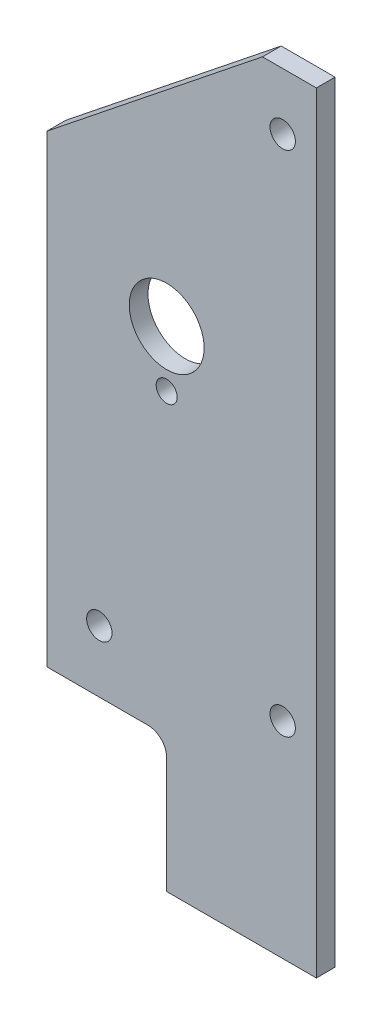
ISO-10303-21;
HEADER;
FILE_DESCRIPTION(('STEP AP214'),'2;1');
FILE_NAME('part.step','',(''),(''),'','','');
FILE_SCHEMA(('AUTOMOTIVE_DESIGN { 1 0 10303 214 1 1 1 1 }'));
ENDSEC;
DATA;
#1=APPLICATION_CONTEXT('core data for automotive mechanical design processes');
#2=APPLICATION_PROTOCOL_DEFINITION('international standard','automotive_design',2000,#1);
#3=PRODUCT_CONTEXT('',#1,'mechanical');
#4=PRODUCT('Part','Part','',(#3));
#5=PRODUCT_RELATED_PRODUCT_CATEGORY('part','',(#4));
#6=PRODUCT_DEFINITION_FORMATION('','',#4);
#7=PRODUCT_DEFINITION_CONTEXT('part definition',#1,'design');
#8=PRODUCT_DEFINITION('design','',#6,#7);
#9=PRODUCT_DEFINITION_SHAPE('','',#8);
#10=(LENGTH_UNIT() NAMED_UNIT(*) SI_UNIT(.MILLI.,.METRE.));
#11=(NAMED_UNIT(*) PLANE_ANGLE_UNIT() SI_UNIT($,.RADIAN.));
#12=(NAMED_UNIT(*) SI_UNIT($,.STERADIAN.) SOLID_ANGLE_UNIT());
#13=UNCERTAINTY_MEASURE_WITH_UNIT(LENGTH_MEASURE(1.E-05),#10,'distance_accuracy_value','');
#14=(GEOMETRIC_REPRESENTATION_CONTEXT(3) GLOBAL_UNCERTAINTY_ASSIGNED_CONTEXT((#13)) GLOBAL_UNIT_ASSIGNED_CONTEXT((#10,
#11,#12)) REPRESENTATION_CONTEXT('',''));
#15=CARTESIAN_POINT('',(0.,0.,0.));
#16=DIRECTION('',(0.,0.,1.));
#17=DIRECTION('',(1.,0.,0.));
#18=AXIS2_PLACEMENT_3D('',#15,#16,#17);
#19=CARTESIAN_POINT('',(-25.4,19.685,-3.175));
#20=DIRECTION('',(-1.,0.,0.));
#21=DIRECTION('',(0.,-1.,0.));
#22=AXIS2_PLACEMENT_3D('',#19,#20,#21);
#23=PLANE('',#22);
#24=DIRECTION('',(0.,-1.,0.));
#25=VECTOR('',#24,1.);
#26=CARTESIAN_POINT('',(-25.4,19.685,0.));
#27=LINE('',#26,#25);
#28=CARTESIAN_POINT('',(-25.4,19.685,0.));
#29=VERTEX_POINT('',#28);
#30=CARTESIAN_POINT('',(-25.4,0.,0.));
#31=VERTEX_POINT('',#30);
#32=EDGE_CURVE('E129',#29,#31,#27,.T.);
#33=ORIENTED_EDGE('',*,*,#32,.F.);
#34=DIRECTION('',(0.,0.,1.));
#35=VECTOR('',#34,1.);
#36=CARTESIAN_POINT('',(-25.4,19.685,-3.175));
#37=LINE('',#36,#35);
#38=CARTESIAN_POINT('',(-25.4,19.685,-3.175));
#39=VERTEX_POINT('',#38);
#40=EDGE_CURVE('E11',#39,#29,#37,.T.);
#41=ORIENTED_EDGE('',*,*,#40,.F.);
#42=DIRECTION('',(0.,-1.,0.));
#43=VECTOR('',#42,1.);
#44=CARTESIAN_POINT('',(-25.4,19.685,-3.175));
#45=LINE('',#44,#43);
#46=CARTESIAN_POINT('',(-25.4,0.,-3.175));
#47=VERTEX_POINT('',#46);
#48=EDGE_CURVE('E150',#39,#47,#45,.T.);
#49=ORIENTED_EDGE('',*,*,#48,.T.);
#50=DIRECTION('',(0.,0.,1.));
#51=VECTOR('',#50,1.);
#52=CARTESIAN_POINT('',(-25.4,0.,-3.175));
#53=LINE('',#52,#51);
#54=EDGE_CURVE('E35',#47,#31,#53,.T.);
#55=ORIENTED_EDGE('',*,*,#54,.T.);
#56=EDGE_LOOP('',(#33,#41,#49,#55));
#57=FACE_BOUND('',#56,.T.);
#58=ADVANCED_FACE('F32',(#57),#23,.T.);
#59=CARTESIAN_POINT('',(-28.575,19.685,-3.175));
#60=DIRECTION('',(0.,0.,1.));
#61=DIRECTION('',(1.,0.,0.));
#62=AXIS2_PLACEMENT_3D('',#59,#60,#61);
#63=CYLINDRICAL_SURFACE('',#62,3.175);
#64=CARTESIAN_POINT('',(-28.575,19.685,0.));
#65=DIRECTION('',(0.,0.,-1.));
#66=DIRECTION('',(1.,0.,0.));
#67=AXIS2_PLACEMENT_3D('',#64,#65,#66);
#68=CIRCLE('',#67,3.175);
#69=CARTESIAN_POINT('',(-28.575,22.86,0.));
#70=VERTEX_POINT('',#69);
#71=EDGE_CURVE('E148',#70,#29,#68,.T.);
#72=ORIENTED_EDGE('',*,*,#71,.F.);
#73=DIRECTION('',(0.,0.,1.));
#74=VECTOR('',#73,1.);
#75=CARTESIAN_POINT('',(-28.575,22.86,-3.175));
#76=LINE('',#75,#74);
#77=CARTESIAN_POINT('',(-28.575,22.86,-3.175));
#78=VERTEX_POINT('',#77);
#79=EDGE_CURVE('E41',#78,#70,#76,.T.);
#80=ORIENTED_EDGE('',*,*,#79,.F.);
#81=CARTESIAN_POINT('',(-28.575,19.685,-3.175));
#82=DIRECTION('',(0.,0.,-1.));
#83=DIRECTION('',(1.,0.,0.));
#84=AXIS2_PLACEMENT_3D('',#81,#82,#83);
#85=CIRCLE('',#84,3.175);
#86=EDGE_CURVE('E119',#78,#39,#85,.T.);
#87=ORIENTED_EDGE('',*,*,#86,.T.);
#88=ORIENTED_EDGE('',*,*,#40,.T.);
#89=EDGE_LOOP('',(#72,#80,#87,#88));
#90=FACE_BOUND('',#89,.T.);
#91=ADVANCED_FACE('F162',(#90),#63,.F.);
#92=CARTESIAN_POINT('',(-45.72,22.86,-3.175));
#93=DIRECTION('',(0.,-1.,0.));
#94=DIRECTION('',(0.,0.,-1.));
#95=AXIS2_PLACEMENT_3D('',#92,#93,#94);
#96=PLANE('',#95);
#97=DIRECTION('',(1.,0.,0.));
#98=VECTOR('',#97,1.);
#99=CARTESIAN_POINT('',(-45.72,22.86,0.));
#100=LINE('',#99,#98);
#101=CARTESIAN_POINT('',(-45.72,22.86,0.));
#102=VERTEX_POINT('',#101);
#103=EDGE_CURVE('E106',#102,#70,#100,.T.);
#104=ORIENTED_EDGE('',*,*,#103,.F.);
#105=DIRECTION('',(0.,0.,1.));
#106=VECTOR('',#105,1.);
#107=CARTESIAN_POINT('',(-45.72,22.86,-3.175));
#108=LINE('',#107,#106);
#109=CARTESIAN_POINT('',(-45.72,22.86,-3.175));
#110=VERTEX_POINT('',#109);
#111=EDGE_CURVE('E101',#110,#102,#108,.T.);
#112=ORIENTED_EDGE('',*,*,#111,.F.);
#113=DIRECTION('',(1.,0.,0.));
#114=VECTOR('',#113,1.);
#115=CARTESIAN_POINT('',(-45.72,22.86,-3.175));
#116=LINE('',#115,#114);
#117=EDGE_CURVE('E104',#110,#78,#116,.T.);
#118=ORIENTED_EDGE('',*,*,#117,.T.);
#119=ORIENTED_EDGE('',*,*,#79,.T.);
#120=EDGE_LOOP('',(#104,#112,#118,#119));
#121=FACE_BOUND('',#120,.T.);
#122=ADVANCED_FACE('F103',(#121),#96,.T.);
#123=CARTESIAN_POINT('',(-45.72,101.6,-3.175));
#124=DIRECTION('',(-1.,0.,0.));
#125=DIRECTION('',(0.,0.,1.));
#126=AXIS2_PLACEMENT_3D('',#123,#124,#125);
#127=PLANE('',#126);
#128=DIRECTION('',(0.,-1.,0.));
#129=VECTOR('',#128,1.);
#130=CARTESIAN_POINT('',(-45.72,101.6,0.));
#131=LINE('',#130,#129);
#132=CARTESIAN_POINT('',(-45.72,101.6,0.));
#133=VERTEX_POINT('',#132);
#134=EDGE_CURVE('E145',#133,#102,#131,.T.);
#135=ORIENTED_EDGE('',*,*,#134,.F.);
#136=DIRECTION('',(0.,0.,1.));
#137=VECTOR('',#136,1.);
#138=CARTESIAN_POINT('',(-45.72,101.6,-3.175));
#139=LINE('',#138,#137);
#140=CARTESIAN_POINT('',(-45.72,101.6,-3.175));
#141=VERTEX_POINT('',#140);
#142=EDGE_CURVE('E111',#141,#133,#139,.T.);
#143=ORIENTED_EDGE('',*,*,#142,.F.);
#144=DIRECTION('',(0.,-1.,0.));
#145=VECTOR('',#144,1.);
#146=CARTESIAN_POINT('',(-45.72,101.6,-3.175));
#147=LINE('',#146,#145);
#148=EDGE_CURVE('E117',#141,#110,#147,.T.);
#149=ORIENTED_EDGE('',*,*,#148,.T.);
#150=ORIENTED_EDGE('',*,*,#111,.T.);
#151=EDGE_LOOP('',(#135,#143,#149,#150));
#152=FACE_BOUND('',#151,.T.);
#153=ADVANCED_FACE('F121',(#152),#127,.T.);
#154=CARTESIAN_POINT('',(-9.144,130.81,-3.175));
#155=DIRECTION('',(-0.624033070240706,0.78139793143184,0.));
#156=DIRECTION('',(-0.78139793143184,-0.624033070240706,0.));
#157=AXIS2_PLACEMENT_3D('',#154,#155,#156);
#158=PLANE('',#157);
#159=DIRECTION('',(-0.78139793143184,-0.624033070240706,0.));
#160=VECTOR('',#159,1.);
#161=CARTESIAN_POINT('',(-9.144,130.81,0.));
#162=LINE('',#161,#160);
#163=CARTESIAN_POINT('',(-9.144,130.81,0.));
#164=VERTEX_POINT('',#163);
#165=EDGE_CURVE('E142',#164,#133,#162,.T.);
#166=ORIENTED_EDGE('',*,*,#165,.F.);
#167=DIRECTION('',(0.,0.,1.));
#168=VECTOR('',#167,1.);
#169=CARTESIAN_POINT('',(-9.144,130.81,-3.175));
#170=LINE('',#169,#168);
#171=CARTESIAN_POINT('',(-9.144,130.81,-3.175));
#172=VERTEX_POINT('',#171);
#173=EDGE_CURVE('E154',#172,#164,#170,.T.);
#174=ORIENTED_EDGE('',*,*,#173,.F.);
#175=DIRECTION('',(-0.78139793143184,-0.624033070240706,0.));
#176=VECTOR('',#175,1.);
#177=CARTESIAN_POINT('',(-9.144,130.81,-3.175));
#178=LINE('',#177,#176);
#179=EDGE_CURVE('E122',#172,#141,#178,.T.);
#180=ORIENTED_EDGE('',*,*,#179,.T.);
#181=ORIENTED_EDGE('',*,*,#142,.T.);
#182=EDGE_LOOP('',(#166,#174,#180,#181));
#183=FACE_BOUND('',#182,.T.);
#184=ADVANCED_FACE('F175',(#183),#158,.T.);
#185=CARTESIAN_POINT('',(0.,130.81,-3.175));
#186=DIRECTION('',(0.,1.,0.));
#187=DIRECTION('',(0.,0.,1.));
#188=AXIS2_PLACEMENT_3D('',#185,#186,#187);
#189=PLANE('',#188);
#190=DIRECTION('',(-1.,0.,0.));
#191=VECTOR('',#190,1.);
#192=CARTESIAN_POINT('',(0.,130.81,0.));
#193=LINE('',#192,#191);
#194=CARTESIAN_POINT('',(0.,130.81,0.));
#195=VERTEX_POINT('',#194);
#196=EDGE_CURVE('E139',#195,#164,#193,.T.);
#197=ORIENTED_EDGE('',*,*,#196,.F.);
#198=DIRECTION('',(0.,0.,1.));
#199=VECTOR('',#198,1.);
#200=CARTESIAN_POINT('',(0.,130.81,-3.175));
#201=LINE('',#200,#199);
#202=CARTESIAN_POINT('',(0.,130.81,-3.175));
#203=VERTEX_POINT('',#202);
#204=EDGE_CURVE('E156',#203,#195,#201,.T.);
#205=ORIENTED_EDGE('',*,*,#204,.F.);
#206=DIRECTION('',(-1.,0.,0.));
#207=VECTOR('',#206,1.);
#208=CARTESIAN_POINT('',(0.,130.81,-3.175));
#209=LINE('',#208,#207);
#210=EDGE_CURVE('E124',#203,#172,#209,.T.);
#211=ORIENTED_EDGE('',*,*,#210,.T.);
#212=ORIENTED_EDGE('',*,*,#173,.T.);
#213=EDGE_LOOP('',(#197,#205,#211,#212));
#214=FACE_BOUND('',#213,.T.);
#215=ADVANCED_FACE('F178',(#214),#189,.T.);
#216=CARTESIAN_POINT('',(0.,0.,-3.175));
#217=DIRECTION('',(1.,0.,0.));
#218=DIRECTION('',(0.,1.,0.));
#219=AXIS2_PLACEMENT_3D('',#216,#217,#218);
#220=PLANE('',#219);
#221=DIRECTION('',(0.,1.,0.));
#222=VECTOR('',#221,1.);
#223=CARTESIAN_POINT('',(0.,0.,0.));
#224=LINE('',#223,#222);
#225=CARTESIAN_POINT('',(0.,0.,0.));
#226=VERTEX_POINT('',#225);
#227=EDGE_CURVE('E136',#226,#195,#224,.T.);
#228=ORIENTED_EDGE('',*,*,#227,.F.);
#229=DIRECTION('',(0.,0.,1.));
#230=VECTOR('',#229,1.);
#231=CARTESIAN_POINT('',(0.,0.,-3.175));
#232=LINE('',#231,#230);
#233=CARTESIAN_POINT('',(0.,0.,-3.175));
#234=VERTEX_POINT('',#233);
#235=EDGE_CURVE('E157',#234,#226,#232,.T.);
#236=ORIENTED_EDGE('',*,*,#235,.F.);
#237=DIRECTION('',(0.,1.,0.));
#238=VECTOR('',#237,1.);
#239=CARTESIAN_POINT('',(0.,0.,-3.175));
#240=LINE('',#239,#238);
#241=EDGE_CURVE('E254',#234,#203,#240,.T.);
#242=ORIENTED_EDGE('',*,*,#241,.T.);
#243=ORIENTED_EDGE('',*,*,#204,.T.);
#244=EDGE_LOOP('',(#228,#236,#242,#243));
#245=FACE_BOUND('',#244,.T.);
#246=ADVANCED_FACE('F182',(#245),#220,.T.);
#247=CARTESIAN_POINT('',(-25.4,0.,-3.175));
#248=DIRECTION('',(0.,-1.,0.));
#249=DIRECTION('',(0.,0.,-1.));
#250=AXIS2_PLACEMENT_3D('',#247,#248,#249);
#251=PLANE('',#250);
#252=DIRECTION('',(1.,0.,0.));
#253=VECTOR('',#252,1.);
#254=CARTESIAN_POINT('',(-25.4,0.,0.));
#255=LINE('',#254,#253);
#256=EDGE_CURVE('E132',#31,#226,#255,.T.);
#257=ORIENTED_EDGE('',*,*,#256,.F.);
#258=ORIENTED_EDGE('',*,*,#54,.F.);
#259=DIRECTION('',(1.,0.,0.));
#260=VECTOR('',#259,1.);
#261=CARTESIAN_POINT('',(-25.4,0.,-3.175));
#262=LINE('',#261,#260);
#263=EDGE_CURVE('E252',#47,#234,#262,.T.);
#264=ORIENTED_EDGE('',*,*,#263,.T.);
#265=ORIENTED_EDGE('',*,*,#235,.T.);
#266=EDGE_LOOP('',(#257,#258,#264,#265));
#267=FACE_BOUND('',#266,.T.);
#268=ADVANCED_FACE('F159',(#267),#251,.T.);
#269=CARTESIAN_POINT('',(-28.575,19.685,-3.175));
#270=DIRECTION('',(0.,0.,1.));
#271=DIRECTION('',(1.,0.,0.));
#272=AXIS2_PLACEMENT_3D('',#269,#270,#271);
#273=PLANE('',#272);
#274=CARTESIAN_POINT('',(-25.4,73.533,-3.175));
#275=DIRECTION('',(0.,0.,1.));
#276=DIRECTION('',(1.,0.,0.));
#277=AXIS2_PLACEMENT_3D('',#274,#275,#276);
#278=CIRCLE('',#277,1.786001);
#279=CARTESIAN_POINT('',(-23.613999,73.533,-3.175));
#280=VERTEX_POINT('',#279);
#281=EDGE_CURVE('E221',#280,#280,#278,.T.);
#282=ORIENTED_EDGE('',*,*,#281,.T.);
#283=EDGE_LOOP('',(#282));
#284=FACE_BOUND('',#283,.T.);
#285=CARTESIAN_POINT('',(-25.4,83.058,-3.175));
#286=DIRECTION('',(0.,0.,1.));
#287=DIRECTION('',(1.,0.,0.));
#288=AXIS2_PLACEMENT_3D('',#285,#286,#287);
#289=CIRCLE('',#288,6.34999999999999);
#290=CARTESIAN_POINT('',(-19.05,83.058,-3.175));
#291=VERTEX_POINT('',#290);
#292=EDGE_CURVE('E231',#291,#291,#289,.T.);
#293=ORIENTED_EDGE('',*,*,#292,.T.);
#294=EDGE_LOOP('',(#293));
#295=FACE_BOUND('',#294,.T.);
#296=CARTESIAN_POINT('',(-5.715,34.925,-3.175));
#297=DIRECTION('',(0.,0.,1.));
#298=DIRECTION('',(1.,0.,0.));
#299=AXIS2_PLACEMENT_3D('',#296,#297,#298);
#300=CIRCLE('',#299,2.15265);
#301=CARTESIAN_POINT('',(-3.56235,34.925,-3.175));
#302=VERTEX_POINT('',#301);
#303=EDGE_CURVE('E237',#302,#302,#300,.T.);
#304=ORIENTED_EDGE('',*,*,#303,.T.);
#305=EDGE_LOOP('',(#304));
#306=FACE_BOUND('',#305,.T.);
#307=CARTESIAN_POINT('',(-36.83,33.3375,-3.175));
#308=DIRECTION('',(0.,0.,1.));
#309=DIRECTION('',(1.,0.,0.));
#310=AXIS2_PLACEMENT_3D('',#307,#308,#309);
#311=CIRCLE('',#310,2.15265);
#312=CARTESIAN_POINT('',(-34.67735,33.3375,-3.175));
#313=VERTEX_POINT('',#312);
#314=EDGE_CURVE('E243',#313,#313,#311,.T.);
#315=ORIENTED_EDGE('',*,*,#314,.T.);
#316=EDGE_LOOP('',(#315));
#317=FACE_BOUND('',#316,.T.);
#318=CARTESIAN_POINT('',(-5.715,121.158,-3.175));
#319=DIRECTION('',(0.,0.,1.));
#320=DIRECTION('',(1.,0.,0.));
#321=AXIS2_PLACEMENT_3D('',#318,#319,#320);
#322=CIRCLE('',#321,2.15265);
#323=CARTESIAN_POINT('',(-3.56235,121.158,-3.175));
#324=VERTEX_POINT('',#323);
#325=EDGE_CURVE('E133',#324,#324,#322,.T.);
#326=ORIENTED_EDGE('',*,*,#325,.T.);
#327=EDGE_LOOP('',(#326));
#328=FACE_BOUND('',#327,.T.);
#329=ORIENTED_EDGE('',*,*,#48,.F.);
#330=ORIENTED_EDGE('',*,*,#86,.F.);
#331=ORIENTED_EDGE('',*,*,#117,.F.);
#332=ORIENTED_EDGE('',*,*,#148,.F.);
#333=ORIENTED_EDGE('',*,*,#179,.F.);
#334=ORIENTED_EDGE('',*,*,#210,.F.);
#335=ORIENTED_EDGE('',*,*,#241,.F.);
#336=ORIENTED_EDGE('',*,*,#263,.F.);
#337=EDGE_LOOP('',(#329,#330,#331,#332,#333,#334,#335,#336));
#338=FACE_BOUND('',#337,.T.);
#339=ADVANCED_FACE('F115',(#284,#295,#306,#317,#328,#338),#273,.F.);
#340=CARTESIAN_POINT('',(-28.575,19.685,0.));
#341=DIRECTION('',(0.,0.,1.));
#342=DIRECTION('',(1.,0.,0.));
#343=AXIS2_PLACEMENT_3D('',#340,#341,#342);
#344=PLANE('',#343);
#345=CARTESIAN_POINT('',(-25.4,73.533,0.));
#346=DIRECTION('',(0.,0.,1.));
#347=DIRECTION('',(1.,0.,0.));
#348=AXIS2_PLACEMENT_3D('',#345,#346,#347);
#349=CIRCLE('',#348,1.786001);
#350=CARTESIAN_POINT('',(-23.613999,73.533,0.));
#351=VERTEX_POINT('',#350);
#352=EDGE_CURVE('E224',#351,#351,#349,.T.);
#353=ORIENTED_EDGE('',*,*,#352,.F.);
#354=EDGE_LOOP('',(#353));
#355=FACE_BOUND('',#354,.T.);
#356=CARTESIAN_POINT('',(-25.4,83.058,0.));
#357=DIRECTION('',(0.,0.,1.));
#358=DIRECTION('',(1.,0.,0.));
#359=AXIS2_PLACEMENT_3D('',#356,#357,#358);
#360=CIRCLE('',#359,6.34999999999999);
#361=CARTESIAN_POINT('',(-19.05,83.058,0.));
#362=VERTEX_POINT('',#361);
#363=EDGE_CURVE('E226',#362,#362,#360,.T.);
#364=ORIENTED_EDGE('',*,*,#363,.F.);
#365=EDGE_LOOP('',(#364));
#366=FACE_BOUND('',#365,.T.);
#367=CARTESIAN_POINT('',(-5.715,34.925,0.));
#368=DIRECTION('',(0.,0.,1.));
#369=DIRECTION('',(1.,0.,0.));
#370=AXIS2_PLACEMENT_3D('',#367,#368,#369);
#371=CIRCLE('',#370,2.15264999999999);
#372=CARTESIAN_POINT('',(-3.56235000000001,34.925,0.));
#373=VERTEX_POINT('',#372);
#374=EDGE_CURVE('E234',#373,#373,#371,.T.);
#375=ORIENTED_EDGE('',*,*,#374,.F.);
#376=EDGE_LOOP('',(#375));
#377=FACE_BOUND('',#376,.T.);
#378=CARTESIAN_POINT('',(-36.83,33.3375,0.));
#379=DIRECTION('',(0.,0.,1.));
#380=DIRECTION('',(1.,0.,0.));
#381=AXIS2_PLACEMENT_3D('',#378,#379,#380);
#382=CIRCLE('',#381,2.15264999999999);
#383=CARTESIAN_POINT('',(-34.67735,33.3375,0.));
#384=VERTEX_POINT('',#383);
#385=EDGE_CURVE('E240',#384,#384,#382,.T.);
#386=ORIENTED_EDGE('',*,*,#385,.F.);
#387=EDGE_LOOP('',(#386));
#388=FACE_BOUND('',#387,.T.);
#389=CARTESIAN_POINT('',(-5.715,121.158,0.));
#390=DIRECTION('',(0.,0.,1.));
#391=DIRECTION('',(1.,0.,0.));
#392=AXIS2_PLACEMENT_3D('',#389,#390,#391);
#393=CIRCLE('',#392,2.15264999999999);
#394=CARTESIAN_POINT('',(-3.56235000000001,121.158,0.));
#395=VERTEX_POINT('',#394);
#396=EDGE_CURVE('E246',#395,#395,#393,.T.);
#397=ORIENTED_EDGE('',*,*,#396,.F.);
#398=EDGE_LOOP('',(#397));
#399=FACE_BOUND('',#398,.T.);
#400=ORIENTED_EDGE('',*,*,#32,.T.);
#401=ORIENTED_EDGE('',*,*,#256,.T.);
#402=ORIENTED_EDGE('',*,*,#227,.T.);
#403=ORIENTED_EDGE('',*,*,#196,.T.);
#404=ORIENTED_EDGE('',*,*,#165,.T.);
#405=ORIENTED_EDGE('',*,*,#134,.T.);
#406=ORIENTED_EDGE('',*,*,#103,.T.);
#407=ORIENTED_EDGE('',*,*,#71,.T.);
#408=EDGE_LOOP('',(#400,#401,#402,#403,#404,#405,#406,#407));
#409=FACE_BOUND('',#408,.T.);
#410=ADVANCED_FACE('F161',(#355,#366,#377,#388,#399,#409),#344,.T.);
#411=CARTESIAN_POINT('',(-5.715,121.158,0.));
#412=DIRECTION('',(0.,0.,1.));
#413=DIRECTION('',(1.,0.,0.));
#414=AXIS2_PLACEMENT_3D('',#411,#412,#413);
#415=CYLINDRICAL_SURFACE('',#414,2.15264999999999);
#416=ORIENTED_EDGE('',*,*,#325,.F.);
#417=EDGE_LOOP('',(#416));
#418=FACE_BOUND('',#417,.T.);
#419=ORIENTED_EDGE('',*,*,#396,.T.);
#420=EDGE_LOOP('',(#419));
#421=FACE_BOUND('',#420,.T.);
#422=ADVANCED_FACE('F194',(#418,#421),#415,.F.);
#423=CARTESIAN_POINT('',(-36.83,33.3375,0.));
#424=DIRECTION('',(0.,0.,1.));
#425=DIRECTION('',(1.,0.,0.));
#426=AXIS2_PLACEMENT_3D('',#423,#424,#425);
#427=CYLINDRICAL_SURFACE('',#426,2.15264999999999);
#428=ORIENTED_EDGE('',*,*,#314,.F.);
#429=EDGE_LOOP('',(#428));
#430=FACE_BOUND('',#429,.T.);
#431=ORIENTED_EDGE('',*,*,#385,.T.);
#432=EDGE_LOOP('',(#431));
#433=FACE_BOUND('',#432,.T.);
#434=ADVANCED_FACE('F201',(#430,#433),#427,.F.);
#435=CARTESIAN_POINT('',(-5.715,34.925,0.));
#436=DIRECTION('',(0.,0.,1.));
#437=DIRECTION('',(1.,0.,0.));
#438=AXIS2_PLACEMENT_3D('',#435,#436,#437);
#439=CYLINDRICAL_SURFACE('',#438,2.15264999999999);
#440=ORIENTED_EDGE('',*,*,#303,.F.);
#441=EDGE_LOOP('',(#440));
#442=FACE_BOUND('',#441,.T.);
#443=ORIENTED_EDGE('',*,*,#374,.T.);
#444=EDGE_LOOP('',(#443));
#445=FACE_BOUND('',#444,.T.);
#446=ADVANCED_FACE('F205',(#442,#445),#439,.F.);
#447=CARTESIAN_POINT('',(-25.4,83.058,0.));
#448=DIRECTION('',(0.,0.,1.));
#449=DIRECTION('',(1.,0.,0.));
#450=AXIS2_PLACEMENT_3D('',#447,#448,#449);
#451=CYLINDRICAL_SURFACE('',#450,6.34999999999999);
#452=ORIENTED_EDGE('',*,*,#292,.F.);
#453=EDGE_LOOP('',(#452));
#454=FACE_BOUND('',#453,.T.);
#455=ORIENTED_EDGE('',*,*,#363,.T.);
#456=EDGE_LOOP('',(#455));
#457=FACE_BOUND('',#456,.T.);
#458=ADVANCED_FACE('F209',(#454,#457),#451,.F.);
#459=CARTESIAN_POINT('',(-25.4,73.533,0.));
#460=DIRECTION('',(0.,0.,1.));
#461=DIRECTION('',(1.,0.,0.));
#462=AXIS2_PLACEMENT_3D('',#459,#460,#461);
#463=CYLINDRICAL_SURFACE('',#462,1.786001);
#464=ORIENTED_EDGE('',*,*,#281,.F.);
#465=EDGE_LOOP('',(#464));
#466=FACE_BOUND('',#465,.T.);
#467=ORIENTED_EDGE('',*,*,#352,.T.);
#468=EDGE_LOOP('',(#467));
#469=FACE_BOUND('',#468,.T.);
#470=ADVANCED_FACE('F213',(#466,#469),#463,.F.);
#471=CLOSED_SHELL('',(#58,#91,#122,#153,#184,#215,#246,#268,#339,#410,#422,#434,#446,#458,#470));
#472=MANIFOLD_SOLID_BREP('B2',#471);
#473=ADVANCED_BREP_SHAPE_REPRESENTATION('',(#18,#472),#14);
#474=SHAPE_DEFINITION_REPRESENTATION(#9,#473);
ENDSEC;
END-ISO-10303-21;
